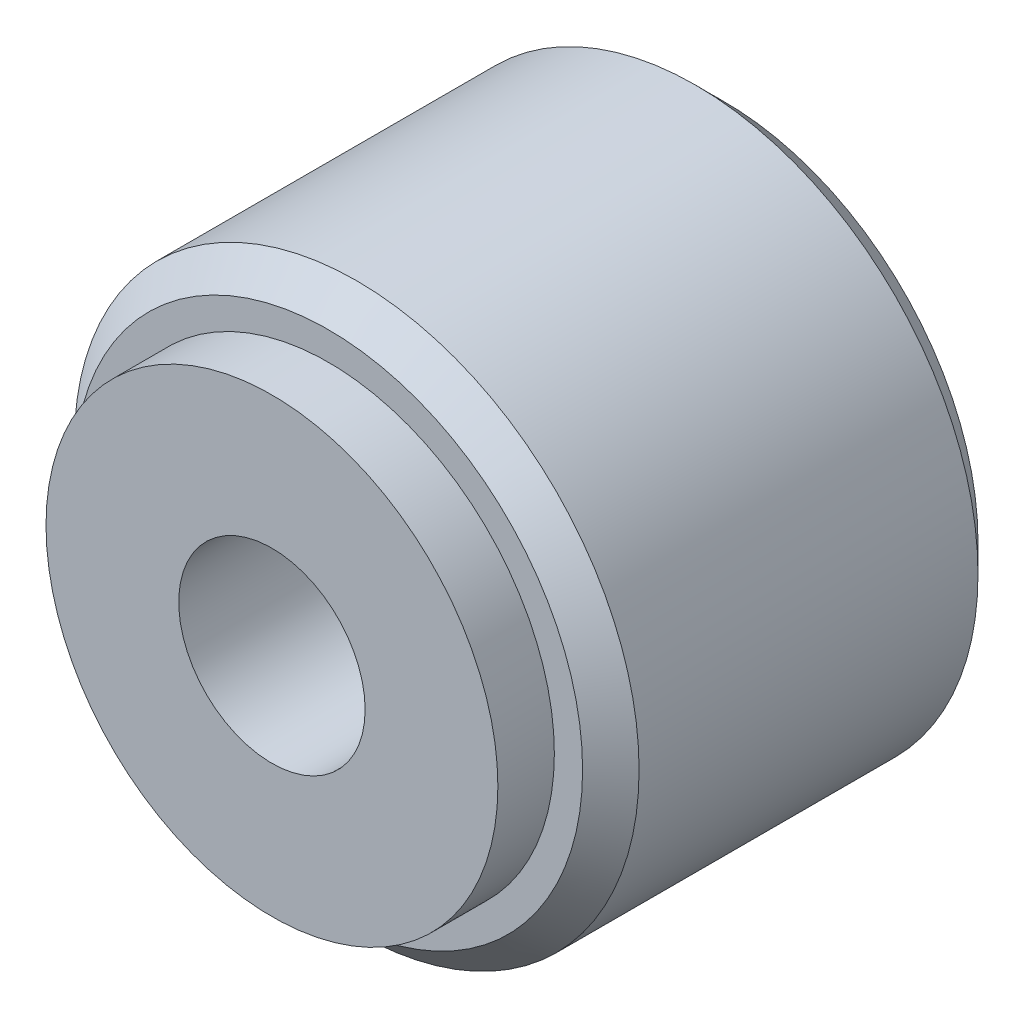
ISO-10303-21;
HEADER;
FILE_DESCRIPTION(('STEP AP214'),'2;1');
FILE_NAME('part.step','',(''),(''),'','','');
FILE_SCHEMA(('AUTOMOTIVE_DESIGN { 1 0 10303 214 1 1 1 1 }'));
ENDSEC;
DATA;
#1=APPLICATION_CONTEXT('core data for automotive mechanical design processes');
#2=APPLICATION_PROTOCOL_DEFINITION('international standard','automotive_design',2000,#1);
#3=PRODUCT_CONTEXT('',#1,'mechanical');
#4=PRODUCT('Part','Part','',(#3));
#5=PRODUCT_RELATED_PRODUCT_CATEGORY('part','',(#4));
#6=PRODUCT_DEFINITION_FORMATION('','',#4);
#7=PRODUCT_DEFINITION_CONTEXT('part definition',#1,'design');
#8=PRODUCT_DEFINITION('design','',#6,#7);
#9=PRODUCT_DEFINITION_SHAPE('','',#8);
#10=(LENGTH_UNIT() NAMED_UNIT(*) SI_UNIT(.MILLI.,.METRE.));
#11=(NAMED_UNIT(*) PLANE_ANGLE_UNIT() SI_UNIT($,.RADIAN.));
#12=(NAMED_UNIT(*) SI_UNIT($,.STERADIAN.) SOLID_ANGLE_UNIT());
#13=UNCERTAINTY_MEASURE_WITH_UNIT(LENGTH_MEASURE(1.E-05),#10,'distance_accuracy_value','');
#14=(GEOMETRIC_REPRESENTATION_CONTEXT(3) GLOBAL_UNCERTAINTY_ASSIGNED_CONTEXT((#13)) GLOBAL_UNIT_ASSIGNED_CONTEXT((#10,
#11,#12)) REPRESENTATION_CONTEXT('',''));
#15=CARTESIAN_POINT('',(0.,0.,0.));
#16=DIRECTION('',(0.,0.,1.));
#17=DIRECTION('',(1.,0.,0.));
#18=AXIS2_PLACEMENT_3D('',#15,#16,#17);
#19=CARTESIAN_POINT('',(0.,0.,7.));
#20=DIRECTION('',(0.,0.,1.));
#21=DIRECTION('',(1.,0.,0.));
#22=AXIS2_PLACEMENT_3D('',#19,#20,#21);
#23=PLANE('',#22);
#24=CARTESIAN_POINT('',(0.,0.,7.));
#25=DIRECTION('',(0.,0.,1.));
#26=DIRECTION('',(1.,0.,0.));
#27=AXIS2_PLACEMENT_3D('',#24,#25,#26);
#28=CIRCLE('',#27,4.5);
#29=CARTESIAN_POINT('',(4.5,0.,7.));
#30=VERTEX_POINT('',#29);
#31=EDGE_CURVE('E69',#30,#30,#28,.T.);
#32=ORIENTED_EDGE('',*,*,#31,.T.);
#33=EDGE_LOOP('',(#32));
#34=FACE_BOUND('',#33,.T.);
#35=CARTESIAN_POINT('',(0.,0.,7.));
#36=DIRECTION('',(0.,0.,1.));
#37=DIRECTION('',(1.,0.,0.));
#38=AXIS2_PLACEMENT_3D('',#35,#36,#37);
#39=CIRCLE('',#38,4.);
#40=CARTESIAN_POINT('',(4.,0.,7.));
#41=VERTEX_POINT('',#40);
#42=EDGE_CURVE('E59',#41,#41,#39,.T.);
#43=ORIENTED_EDGE('',*,*,#42,.F.);
#44=EDGE_LOOP('',(#43));
#45=FACE_BOUND('',#44,.T.);
#46=ADVANCED_FACE('F39',(#34,#45),#23,.T.);
#47=CARTESIAN_POINT('',(0.,0.,7.));
#48=DIRECTION('',(0.,0.,-1.));
#49=DIRECTION('',(-1.,0.,0.));
#50=AXIS2_PLACEMENT_3D('',#47,#48,#49);
#51=CYLINDRICAL_SURFACE('',#50,5.);
#52=CARTESIAN_POINT('',(0.,0.,6.5));
#53=DIRECTION('',(0.,0.,1.));
#54=DIRECTION('',(1.,0.,0.));
#55=AXIS2_PLACEMENT_3D('',#52,#53,#54);
#56=CIRCLE('',#55,5.);
#57=CARTESIAN_POINT('',(5.,0.,6.5));
#58=VERTEX_POINT('',#57);
#59=EDGE_CURVE('E46',#58,#58,#56,.F.);
#60=ORIENTED_EDGE('',*,*,#59,.T.);
#61=EDGE_LOOP('',(#60));
#62=FACE_BOUND('',#61,.T.);
#63=CARTESIAN_POINT('',(0.,0.,0.500000000000002));
#64=DIRECTION('',(0.,0.,1.));
#65=DIRECTION('',(1.,0.,0.));
#66=AXIS2_PLACEMENT_3D('',#63,#64,#65);
#67=CIRCLE('',#66,5.);
#68=CARTESIAN_POINT('',(5.,0.,0.500000000000002));
#69=VERTEX_POINT('',#68);
#70=EDGE_CURVE('E73',#69,#69,#67,.T.);
#71=ORIENTED_EDGE('',*,*,#70,.T.);
#72=EDGE_LOOP('',(#71));
#73=FACE_BOUND('',#72,.T.);
#74=ADVANCED_FACE('F78',(#62,#73),#51,.T.);
#75=CARTESIAN_POINT('',(0.,0.,0.));
#76=DIRECTION('',(0.,0.,1.));
#77=DIRECTION('',(1.,0.,0.));
#78=AXIS2_PLACEMENT_3D('',#75,#76,#77);
#79=PLANE('',#78);
#80=CARTESIAN_POINT('',(0.,0.,0.));
#81=DIRECTION('',(0.,0.,1.));
#82=DIRECTION('',(1.,0.,0.));
#83=AXIS2_PLACEMENT_3D('',#80,#81,#82);
#84=CIRCLE('',#83,4.5);
#85=CARTESIAN_POINT('',(4.5,0.,0.));
#86=VERTEX_POINT('',#85);
#87=EDGE_CURVE('E11',#86,#86,#84,.F.);
#88=ORIENTED_EDGE('',*,*,#87,.T.);
#89=EDGE_LOOP('',(#88));
#90=FACE_BOUND('',#89,.T.);
#91=ADVANCED_FACE('F93',(#90),#79,.F.);
#92=CARTESIAN_POINT('',(0.,0.,8.));
#93=DIRECTION('',(0.,0.,-1.));
#94=DIRECTION('',(-1.,0.,0.));
#95=AXIS2_PLACEMENT_3D('',#92,#93,#94);
#96=CYLINDRICAL_SURFACE('',#95,4.);
#97=CARTESIAN_POINT('',(0.,0.,8.));
#98=DIRECTION('',(0.,0.,1.));
#99=DIRECTION('',(1.,0.,0.));
#100=AXIS2_PLACEMENT_3D('',#97,#98,#99);
#101=CIRCLE('',#100,4.);
#102=CARTESIAN_POINT('',(4.,0.,8.));
#103=VERTEX_POINT('',#102);
#104=EDGE_CURVE('E63',#103,#103,#101,.T.);
#105=ORIENTED_EDGE('',*,*,#104,.F.);
#106=EDGE_LOOP('',(#105));
#107=FACE_BOUND('',#106,.T.);
#108=ORIENTED_EDGE('',*,*,#42,.T.);
#109=EDGE_LOOP('',(#108));
#110=FACE_BOUND('',#109,.T.);
#111=ADVANCED_FACE('F91',(#107,#110),#96,.T.);
#112=CARTESIAN_POINT('',(0.,0.,8.));
#113=DIRECTION('',(0.,0.,1.));
#114=DIRECTION('',(1.,0.,0.));
#115=AXIS2_PLACEMENT_3D('',#112,#113,#114);
#116=PLANE('',#115);
#117=CARTESIAN_POINT('',(0.,0.,8.));
#118=DIRECTION('',(0.,0.,1.));
#119=DIRECTION('',(1.,0.,0.));
#120=AXIS2_PLACEMENT_3D('',#117,#118,#119);
#121=CIRCLE('',#120,1.64999999999999);
#122=CARTESIAN_POINT('',(1.64999999999999,0.,8.));
#123=VERTEX_POINT('',#122);
#124=EDGE_CURVE('E60',#123,#123,#121,.T.);
#125=ORIENTED_EDGE('',*,*,#124,.F.);
#126=EDGE_LOOP('',(#125));
#127=FACE_BOUND('',#126,.T.);
#128=ORIENTED_EDGE('',*,*,#104,.T.);
#129=EDGE_LOOP('',(#128));
#130=FACE_BOUND('',#129,.T.);
#131=ADVANCED_FACE('F53',(#127,#130),#116,.T.);
#132=CARTESIAN_POINT('',(0.,0.,2.2));
#133=DIRECTION('',(0.,0.,1.));
#134=DIRECTION('',(1.,0.,0.));
#135=AXIS2_PLACEMENT_3D('',#132,#133,#134);
#136=CONICAL_SURFACE('',#135,1.65,1.02974425867665);
#137=CARTESIAN_POINT('',(0.,0.,1.20857997860453));
#138=VERTEX_POINT('',#137);
#139=VERTEX_LOOP('',#138);
#140=FACE_BOUND('',#139,.T.);
#141=CARTESIAN_POINT('',(0.,0.,2.2));
#142=DIRECTION('',(0.,0.,1.));
#143=DIRECTION('',(1.,0.,0.));
#144=AXIS2_PLACEMENT_3D('',#141,#142,#143);
#145=CIRCLE('',#144,1.65);
#146=CARTESIAN_POINT('',(1.65,0.,2.2));
#147=VERTEX_POINT('',#146);
#148=EDGE_CURVE('E57',#147,#147,#145,.T.);
#149=ORIENTED_EDGE('',*,*,#148,.T.);
#150=EDGE_LOOP('',(#149));
#151=FACE_BOUND('',#150,.T.);
#152=ADVANCED_FACE('F49',(#140,#151),#136,.F.);
#153=CARTESIAN_POINT('',(0.,0.,8.));
#154=DIRECTION('',(0.,0.,1.));
#155=DIRECTION('',(1.,0.,0.));
#156=AXIS2_PLACEMENT_3D('',#153,#154,#155);
#157=CYLINDRICAL_SURFACE('',#156,1.64999999999999);
#158=ORIENTED_EDGE('',*,*,#148,.F.);
#159=EDGE_LOOP('',(#158));
#160=FACE_BOUND('',#159,.T.);
#161=ORIENTED_EDGE('',*,*,#124,.T.);
#162=EDGE_LOOP('',(#161));
#163=FACE_BOUND('',#162,.T.);
#164=ADVANCED_FACE('F52',(#160,#163),#157,.F.);
#165=CARTESIAN_POINT('',(0.,0.,7.));
#166=DIRECTION('',(0.,0.,-1.));
#167=DIRECTION('',(-1.,0.,0.));
#168=AXIS2_PLACEMENT_3D('',#165,#166,#167);
#169=CONICAL_SURFACE('',#168,4.5,0.785398163397445);
#170=ORIENTED_EDGE('',*,*,#59,.F.);
#171=EDGE_LOOP('',(#170));
#172=FACE_BOUND('',#171,.T.);
#173=ORIENTED_EDGE('',*,*,#31,.F.);
#174=EDGE_LOOP('',(#173));
#175=FACE_BOUND('',#174,.T.);
#176=ADVANCED_FACE('F81',(#172,#175),#169,.T.);
#177=CARTESIAN_POINT('',(0.,0.,0.500000000000002));
#178=DIRECTION('',(0.,0.,1.));
#179=DIRECTION('',(1.,0.,0.));
#180=AXIS2_PLACEMENT_3D('',#177,#178,#179);
#181=CONICAL_SURFACE('',#180,5.,0.785398163397449);
#182=ORIENTED_EDGE('',*,*,#87,.F.);
#183=EDGE_LOOP('',(#182));
#184=FACE_BOUND('',#183,.T.);
#185=ORIENTED_EDGE('',*,*,#70,.F.);
#186=EDGE_LOOP('',(#185));
#187=FACE_BOUND('',#186,.T.);
#188=ADVANCED_FACE('F41',(#184,#187),#181,.T.);
#189=CLOSED_SHELL('',(#46,#74,#91,#111,#131,#152,#164,#176,#188));
#190=MANIFOLD_SOLID_BREP('B2',#189);
#191=ADVANCED_BREP_SHAPE_REPRESENTATION('',(#18,#190),#14);
#192=SHAPE_DEFINITION_REPRESENTATION(#9,#191);
ENDSEC;
END-ISO-10303-21;
